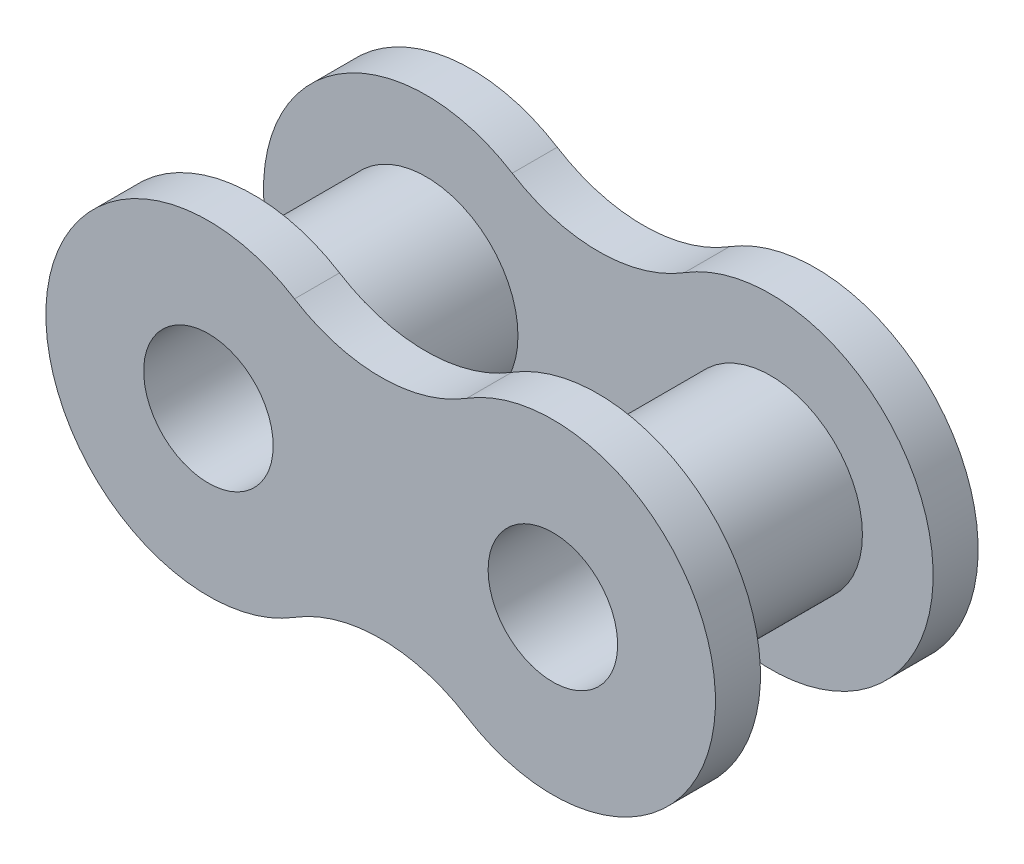
ISO-10303-21;
HEADER;
FILE_DESCRIPTION(('STEP AP214'),'2;1');
FILE_NAME('part.step','',(''),(''),'','','');
FILE_SCHEMA(('AUTOMOTIVE_DESIGN { 1 0 10303 214 1 1 1 1 }'));
ENDSEC;
DATA;
#1=APPLICATION_CONTEXT('core data for automotive mechanical design processes');
#2=APPLICATION_PROTOCOL_DEFINITION('international standard','automotive_design',2000,#1);
#3=PRODUCT_CONTEXT('',#1,'mechanical');
#4=PRODUCT('Part','Part','',(#3));
#5=PRODUCT_RELATED_PRODUCT_CATEGORY('part','',(#4));
#6=PRODUCT_DEFINITION_FORMATION('','',#4);
#7=PRODUCT_DEFINITION_CONTEXT('part definition',#1,'design');
#8=PRODUCT_DEFINITION('design','',#6,#7);
#9=PRODUCT_DEFINITION_SHAPE('','',#8);
#10=(LENGTH_UNIT() NAMED_UNIT(*) SI_UNIT(.MILLI.,.METRE.));
#11=(NAMED_UNIT(*) PLANE_ANGLE_UNIT() SI_UNIT($,.RADIAN.));
#12=(NAMED_UNIT(*) SI_UNIT($,.STERADIAN.) SOLID_ANGLE_UNIT());
#13=UNCERTAINTY_MEASURE_WITH_UNIT(LENGTH_MEASURE(1.E-05),#10,'distance_accuracy_value','');
#14=(GEOMETRIC_REPRESENTATION_CONTEXT(3) GLOBAL_UNCERTAINTY_ASSIGNED_CONTEXT((#13)) GLOBAL_UNIT_ASSIGNED_CONTEXT((#10,
#11,#12)) REPRESENTATION_CONTEXT('',''));
#15=CARTESIAN_POINT('',(0.,0.,0.));
#16=DIRECTION('',(0.,0.,1.));
#17=DIRECTION('',(1.,0.,0.));
#18=AXIS2_PLACEMENT_3D('',#15,#16,#17);
#19=CARTESIAN_POINT('',(2.38125,3.81337987584505,2.3876));
#20=DIRECTION('',(0.,0.,1.));
#21=DIRECTION('',(1.,0.,0.));
#22=AXIS2_PLACEMENT_3D('',#19,#20,#21);
#23=PLANE('',#22);
#24=CARTESIAN_POINT('',(0.,7.62675975169009,2.3876));
#25=DIRECTION('',(0.,0.,-1.));
#26=DIRECTION('',(1.,0.,0.));
#27=AXIS2_PLACEMENT_3D('',#24,#25,#26);
#28=CIRCLE('',#27,4.4958);
#29=CARTESIAN_POINT('',(2.38125,3.81337987584505,2.3876));
#30=VERTEX_POINT('',#29);
#31=CARTESIAN_POINT('',(-2.38125,3.81337987584505,2.3876));
#32=VERTEX_POINT('',#31);
#33=EDGE_CURVE('E190',#30,#32,#28,.T.);
#34=ORIENTED_EDGE('',*,*,#33,.F.);
#35=CARTESIAN_POINT('',(4.7625,0.,2.3876));
#36=DIRECTION('',(0.,0.,1.));
#37=DIRECTION('',(-1.,0.,0.));
#38=AXIS2_PLACEMENT_3D('',#35,#36,#37);
#39=CIRCLE('',#38,4.4958);
#40=CARTESIAN_POINT('',(2.38125,-3.81337987584505,2.3876));
#41=VERTEX_POINT('',#40);
#42=EDGE_CURVE('E86',#41,#30,#39,.T.);
#43=ORIENTED_EDGE('',*,*,#42,.F.);
#44=CARTESIAN_POINT('',(0.,-7.62675975169009,2.3876));
#45=DIRECTION('',(0.,0.,-1.));
#46=DIRECTION('',(-1.,0.,0.));
#47=AXIS2_PLACEMENT_3D('',#44,#45,#46);
#48=CIRCLE('',#47,4.4958);
#49=CARTESIAN_POINT('',(-2.38125,-3.81337987584505,2.3876));
#50=VERTEX_POINT('',#49);
#51=EDGE_CURVE('E80',#50,#41,#48,.T.);
#52=ORIENTED_EDGE('',*,*,#51,.F.);
#53=CARTESIAN_POINT('',(-4.7625,0.,2.3876));
#54=DIRECTION('',(0.,0.,1.));
#55=DIRECTION('',(1.,0.,0.));
#56=AXIS2_PLACEMENT_3D('',#53,#54,#55);
#57=CIRCLE('',#56,4.4958);
#58=EDGE_CURVE('E205',#32,#50,#57,.T.);
#59=ORIENTED_EDGE('',*,*,#58,.F.);
#60=EDGE_LOOP('',(#34,#43,#52,#59));
#61=FACE_BOUND('',#60,.T.);
#62=CARTESIAN_POINT('',(-4.7625,0.,2.3876));
#63=DIRECTION('',(0.,0.,1.));
#64=DIRECTION('',(1.,0.,0.));
#65=AXIS2_PLACEMENT_3D('',#62,#63,#64);
#66=CIRCLE('',#65,2.54);
#67=CARTESIAN_POINT('',(-2.2225,0.,2.3876));
#68=VERTEX_POINT('',#67);
#69=EDGE_CURVE('E54',#68,#68,#66,.T.);
#70=ORIENTED_EDGE('',*,*,#69,.T.);
#71=EDGE_LOOP('',(#70));
#72=FACE_BOUND('',#71,.T.);
#73=CARTESIAN_POINT('',(4.7625,0.,2.3876));
#74=DIRECTION('',(0.,0.,1.));
#75=DIRECTION('',(1.,0.,0.));
#76=AXIS2_PLACEMENT_3D('',#73,#74,#75);
#77=CIRCLE('',#76,2.54);
#78=CARTESIAN_POINT('',(7.3025,0.,2.3876));
#79=VERTEX_POINT('',#78);
#80=EDGE_CURVE('E11',#79,#79,#77,.F.);
#81=ORIENTED_EDGE('',*,*,#80,.F.);
#82=EDGE_LOOP('',(#81));
#83=FACE_BOUND('',#82,.T.);
#84=ADVANCED_FACE('F44',(#61,#72,#83),#23,.F.);
#85=CARTESIAN_POINT('',(-4.7625,0.,2.3876));
#86=DIRECTION('',(0.,0.,-1.));
#87=DIRECTION('',(-1.,0.,0.));
#88=AXIS2_PLACEMENT_3D('',#85,#86,#87);
#89=CYLINDRICAL_SURFACE('',#88,2.54);
#90=ORIENTED_EDGE('',*,*,#69,.F.);
#91=EDGE_LOOP('',(#90));
#92=FACE_BOUND('',#91,.T.);
#93=CARTESIAN_POINT('',(-4.7625,0.,-2.3876));
#94=DIRECTION('',(0.,0.,1.));
#95=DIRECTION('',(1.,0.,0.));
#96=AXIS2_PLACEMENT_3D('',#93,#94,#95);
#97=CIRCLE('',#96,2.54);
#98=CARTESIAN_POINT('',(-2.2225,0.,-2.3876));
#99=VERTEX_POINT('',#98);
#100=EDGE_CURVE('E181',#99,#99,#97,.T.);
#101=ORIENTED_EDGE('',*,*,#100,.T.);
#102=EDGE_LOOP('',(#101));
#103=FACE_BOUND('',#102,.T.);
#104=ADVANCED_FACE('F46',(#92,#103),#89,.T.);
#105=CARTESIAN_POINT('',(-4.7625,0.,2.3876));
#106=DIRECTION('',(0.,0.,-1.));
#107=DIRECTION('',(-1.,0.,0.));
#108=AXIS2_PLACEMENT_3D('',#105,#106,#107);
#109=CYLINDRICAL_SURFACE('',#108,1.7907);
#110=CARTESIAN_POINT('',(-4.7625,0.,3.6322));
#111=DIRECTION('',(0.,0.,1.));
#112=DIRECTION('',(1.,0.,0.));
#113=AXIS2_PLACEMENT_3D('',#110,#111,#112);
#114=CIRCLE('',#113,1.7907);
#115=CARTESIAN_POINT('',(-2.9718,0.,3.6322));
#116=VERTEX_POINT('',#115);
#117=EDGE_CURVE('E186',#116,#116,#114,.T.);
#118=ORIENTED_EDGE('',*,*,#117,.T.);
#119=EDGE_LOOP('',(#118));
#120=FACE_BOUND('',#119,.T.);
#121=CARTESIAN_POINT('',(-4.7625,0.,-3.6322));
#122=DIRECTION('',(0.,0.,1.));
#123=DIRECTION('',(1.,0.,0.));
#124=AXIS2_PLACEMENT_3D('',#121,#122,#123);
#125=CIRCLE('',#124,1.7907);
#126=CARTESIAN_POINT('',(-2.9718,0.,-3.6322));
#127=VERTEX_POINT('',#126);
#128=EDGE_CURVE('E161',#127,#127,#125,.T.);
#129=ORIENTED_EDGE('',*,*,#128,.F.);
#130=EDGE_LOOP('',(#129));
#131=FACE_BOUND('',#130,.T.);
#132=ADVANCED_FACE('F257',(#120,#131),#109,.F.);
#133=CARTESIAN_POINT('',(2.38125,3.81337987584505,3.6322));
#134=DIRECTION('',(0.,0.,1.));
#135=DIRECTION('',(1.,0.,0.));
#136=AXIS2_PLACEMENT_3D('',#133,#134,#135);
#137=PLANE('',#136);
#138=ORIENTED_EDGE('',*,*,#117,.F.);
#139=EDGE_LOOP('',(#138));
#140=FACE_BOUND('',#139,.T.);
#141=CARTESIAN_POINT('',(0.,7.62675975169009,3.6322));
#142=DIRECTION('',(0.,0.,-1.));
#143=DIRECTION('',(1.,0.,0.));
#144=AXIS2_PLACEMENT_3D('',#141,#142,#143);
#145=CIRCLE('',#144,4.4958);
#146=CARTESIAN_POINT('',(2.38125,3.81337987584505,3.6322));
#147=VERTEX_POINT('',#146);
#148=CARTESIAN_POINT('',(-2.38125,3.81337987584505,3.6322));
#149=VERTEX_POINT('',#148);
#150=EDGE_CURVE('E191',#147,#149,#145,.T.);
#151=ORIENTED_EDGE('',*,*,#150,.T.);
#152=CARTESIAN_POINT('',(-4.7625,0.,3.6322));
#153=DIRECTION('',(0.,0.,1.));
#154=DIRECTION('',(1.,0.,0.));
#155=AXIS2_PLACEMENT_3D('',#152,#153,#154);
#156=CIRCLE('',#155,4.4958);
#157=CARTESIAN_POINT('',(-2.38125,-3.81337987584505,3.6322));
#158=VERTEX_POINT('',#157);
#159=EDGE_CURVE('E94',#149,#158,#156,.T.);
#160=ORIENTED_EDGE('',*,*,#159,.T.);
#161=CARTESIAN_POINT('',(0.,-7.62675975169009,3.6322));
#162=DIRECTION('',(0.,0.,-1.));
#163=DIRECTION('',(-1.,0.,0.));
#164=AXIS2_PLACEMENT_3D('',#161,#162,#163);
#165=CIRCLE('',#164,4.4958);
#166=CARTESIAN_POINT('',(2.38125,-3.81337987584505,3.6322));
#167=VERTEX_POINT('',#166);
#168=EDGE_CURVE('E196',#158,#167,#165,.T.);
#169=ORIENTED_EDGE('',*,*,#168,.T.);
#170=CARTESIAN_POINT('',(4.7625,0.,3.6322));
#171=DIRECTION('',(0.,0.,1.));
#172=DIRECTION('',(-1.,0.,0.));
#173=AXIS2_PLACEMENT_3D('',#170,#171,#172);
#174=CIRCLE('',#173,4.4958);
#175=EDGE_CURVE('E62',#167,#147,#174,.T.);
#176=ORIENTED_EDGE('',*,*,#175,.T.);
#177=EDGE_LOOP('',(#151,#160,#169,#176));
#178=FACE_BOUND('',#177,.T.);
#179=CARTESIAN_POINT('',(4.7625,0.,3.6322));
#180=DIRECTION('',(0.,0.,1.));
#181=DIRECTION('',(-1.,0.,0.));
#182=AXIS2_PLACEMENT_3D('',#179,#180,#181);
#183=CIRCLE('',#182,1.7907);
#184=CARTESIAN_POINT('',(2.9718,0.,3.6322));
#185=VERTEX_POINT('',#184);
#186=EDGE_CURVE('E182',#185,#185,#183,.T.);
#187=ORIENTED_EDGE('',*,*,#186,.F.);
#188=EDGE_LOOP('',(#187));
#189=FACE_BOUND('',#188,.T.);
#190=ADVANCED_FACE('F263',(#140,#178,#189),#137,.T.);
#191=CARTESIAN_POINT('',(0.,7.62675975169009,3.6322));
#192=DIRECTION('',(0.,0.,-1.));
#193=DIRECTION('',(-1.,0.,0.));
#194=AXIS2_PLACEMENT_3D('',#191,#192,#193);
#195=CYLINDRICAL_SURFACE('',#194,4.4958);
#196=ORIENTED_EDGE('',*,*,#33,.T.);
#197=DIRECTION('',(0.,0.,-1.));
#198=VECTOR('',#197,1.);
#199=CARTESIAN_POINT('',(-2.38125,3.81337987584505,3.6322));
#200=LINE('',#199,#198);
#201=EDGE_CURVE('E220',#149,#32,#200,.T.);
#202=ORIENTED_EDGE('',*,*,#201,.F.);
#203=ORIENTED_EDGE('',*,*,#150,.F.);
#204=DIRECTION('',(0.,0.,-1.));
#205=VECTOR('',#204,1.);
#206=CARTESIAN_POINT('',(2.38125,3.81337987584505,3.6322));
#207=LINE('',#206,#205);
#208=EDGE_CURVE('E201',#147,#30,#207,.T.);
#209=ORIENTED_EDGE('',*,*,#208,.T.);
#210=EDGE_LOOP('',(#196,#202,#203,#209));
#211=FACE_BOUND('',#210,.T.);
#212=ADVANCED_FACE('F275',(#211),#195,.F.);
#213=CARTESIAN_POINT('',(-4.7625,0.,3.6322));
#214=DIRECTION('',(0.,0.,-1.));
#215=DIRECTION('',(-1.,0.,0.));
#216=AXIS2_PLACEMENT_3D('',#213,#214,#215);
#217=CYLINDRICAL_SURFACE('',#216,4.4958);
#218=ORIENTED_EDGE('',*,*,#58,.T.);
#219=DIRECTION('',(0.,0.,-1.));
#220=VECTOR('',#219,1.);
#221=CARTESIAN_POINT('',(-2.38125,-3.81337987584505,3.6322));
#222=LINE('',#221,#220);
#223=EDGE_CURVE('E217',#158,#50,#222,.T.);
#224=ORIENTED_EDGE('',*,*,#223,.F.);
#225=ORIENTED_EDGE('',*,*,#159,.F.);
#226=ORIENTED_EDGE('',*,*,#201,.T.);
#227=EDGE_LOOP('',(#218,#224,#225,#226));
#228=FACE_BOUND('',#227,.T.);
#229=ADVANCED_FACE('F272',(#228),#217,.T.);
#230=CARTESIAN_POINT('',(0.,-7.62675975169009,3.6322));
#231=DIRECTION('',(0.,0.,-1.));
#232=DIRECTION('',(-1.,0.,0.));
#233=AXIS2_PLACEMENT_3D('',#230,#231,#232);
#234=CYLINDRICAL_SURFACE('',#233,4.4958);
#235=ORIENTED_EDGE('',*,*,#51,.T.);
#236=DIRECTION('',(0.,0.,-1.));
#237=VECTOR('',#236,1.);
#238=CARTESIAN_POINT('',(2.38125,-3.81337987584505,3.6322));
#239=LINE('',#238,#237);
#240=EDGE_CURVE('E214',#167,#41,#239,.T.);
#241=ORIENTED_EDGE('',*,*,#240,.F.);
#242=ORIENTED_EDGE('',*,*,#168,.F.);
#243=ORIENTED_EDGE('',*,*,#223,.T.);
#244=EDGE_LOOP('',(#235,#241,#242,#243));
#245=FACE_BOUND('',#244,.T.);
#246=ADVANCED_FACE('F269',(#245),#234,.F.);
#247=CARTESIAN_POINT('',(4.7625,0.,3.6322));
#248=DIRECTION('',(0.,0.,-1.));
#249=DIRECTION('',(-1.,0.,0.));
#250=AXIS2_PLACEMENT_3D('',#247,#248,#249);
#251=CYLINDRICAL_SURFACE('',#250,4.4958);
#252=ORIENTED_EDGE('',*,*,#42,.T.);
#253=ORIENTED_EDGE('',*,*,#208,.F.);
#254=ORIENTED_EDGE('',*,*,#175,.F.);
#255=ORIENTED_EDGE('',*,*,#240,.T.);
#256=EDGE_LOOP('',(#252,#253,#254,#255));
#257=FACE_BOUND('',#256,.T.);
#258=ADVANCED_FACE('F265',(#257),#251,.T.);
#259=CARTESIAN_POINT('',(4.7625,0.,3.6322));
#260=DIRECTION('',(0.,0.,-1.));
#261=DIRECTION('',(-1.,0.,0.));
#262=AXIS2_PLACEMENT_3D('',#259,#260,#261);
#263=CYLINDRICAL_SURFACE('',#262,1.7907);
#264=ORIENTED_EDGE('',*,*,#186,.T.);
#265=EDGE_LOOP('',(#264));
#266=FACE_BOUND('',#265,.T.);
#267=CARTESIAN_POINT('',(4.7625,0.,-3.6322));
#268=DIRECTION('',(0.,0.,1.));
#269=DIRECTION('',(-1.,0.,0.));
#270=AXIS2_PLACEMENT_3D('',#267,#268,#269);
#271=CIRCLE('',#270,1.7907);
#272=CARTESIAN_POINT('',(2.9718,0.,-3.6322));
#273=VERTEX_POINT('',#272);
#274=EDGE_CURVE('E291',#273,#273,#271,.T.);
#275=ORIENTED_EDGE('',*,*,#274,.F.);
#276=EDGE_LOOP('',(#275));
#277=FACE_BOUND('',#276,.T.);
#278=ADVANCED_FACE('F268',(#266,#277),#263,.F.);
#279=CARTESIAN_POINT('',(4.7625,0.,2.3876));
#280=DIRECTION('',(0.,0.,-1.));
#281=DIRECTION('',(-1.,0.,0.));
#282=AXIS2_PLACEMENT_3D('',#279,#280,#281);
#283=CYLINDRICAL_SURFACE('',#282,2.54);
#284=ORIENTED_EDGE('',*,*,#80,.T.);
#285=EDGE_LOOP('',(#284));
#286=FACE_BOUND('',#285,.T.);
#287=CARTESIAN_POINT('',(4.7625,0.,-2.3876));
#288=DIRECTION('',(0.,0.,1.));
#289=DIRECTION('',(-1.,0.,0.));
#290=AXIS2_PLACEMENT_3D('',#287,#288,#289);
#291=CIRCLE('',#290,2.54);
#292=CARTESIAN_POINT('',(2.2225,0.,-2.3876));
#293=VERTEX_POINT('',#292);
#294=EDGE_CURVE('E133',#293,#293,#291,.T.);
#295=ORIENTED_EDGE('',*,*,#294,.T.);
#296=EDGE_LOOP('',(#295));
#297=FACE_BOUND('',#296,.T.);
#298=ADVANCED_FACE('F298',(#286,#297),#283,.T.);
#299=CARTESIAN_POINT('',(0.,7.62675975169009,-3.6322));
#300=DIRECTION('',(0.,0.,1.));
#301=DIRECTION('',(1.,0.,0.));
#302=AXIS2_PLACEMENT_3D('',#299,#300,#301);
#303=CYLINDRICAL_SURFACE('',#302,4.4958);
#304=CARTESIAN_POINT('',(0.,7.62675975169009,-2.3876));
#305=DIRECTION('',(0.,0.,-1.));
#306=DIRECTION('',(1.,0.,0.));
#307=AXIS2_PLACEMENT_3D('',#304,#305,#306);
#308=CIRCLE('',#307,4.4958);
#309=CARTESIAN_POINT('',(2.38125,3.81337987584505,-2.3876));
#310=VERTEX_POINT('',#309);
#311=CARTESIAN_POINT('',(-2.38125,3.81337987584505,-2.3876));
#312=VERTEX_POINT('',#311);
#313=EDGE_CURVE('E127',#310,#312,#308,.T.);
#314=ORIENTED_EDGE('',*,*,#313,.F.);
#315=DIRECTION('',(0.,0.,1.));
#316=VECTOR('',#315,1.);
#317=CARTESIAN_POINT('',(2.38125,3.81337987584505,-3.6322));
#318=LINE('',#317,#316);
#319=CARTESIAN_POINT('',(2.38125,3.81337987584505,-3.6322));
#320=VERTEX_POINT('',#319);
#321=EDGE_CURVE('E121',#320,#310,#318,.T.);
#322=ORIENTED_EDGE('',*,*,#321,.F.);
#323=CARTESIAN_POINT('',(0.,7.62675975169009,-3.6322));
#324=DIRECTION('',(0.,0.,-1.));
#325=DIRECTION('',(1.,0.,0.));
#326=AXIS2_PLACEMENT_3D('',#323,#324,#325);
#327=CIRCLE('',#326,4.4958);
#328=CARTESIAN_POINT('',(-2.38125,3.81337987584505,-3.6322));
#329=VERTEX_POINT('',#328);
#330=EDGE_CURVE('E124',#320,#329,#327,.T.);
#331=ORIENTED_EDGE('',*,*,#330,.T.);
#332=DIRECTION('',(0.,0.,1.));
#333=VECTOR('',#332,1.);
#334=CARTESIAN_POINT('',(-2.38125,3.81337987584505,-3.6322));
#335=LINE('',#334,#333);
#336=EDGE_CURVE('E157',#329,#312,#335,.T.);
#337=ORIENTED_EDGE('',*,*,#336,.T.);
#338=EDGE_LOOP('',(#314,#322,#331,#337));
#339=FACE_BOUND('',#338,.T.);
#340=ADVANCED_FACE('F123',(#339),#303,.F.);
#341=CARTESIAN_POINT('',(4.7625,0.,-3.6322));
#342=DIRECTION('',(0.,0.,1.));
#343=DIRECTION('',(1.,0.,0.));
#344=AXIS2_PLACEMENT_3D('',#341,#342,#343);
#345=CYLINDRICAL_SURFACE('',#344,4.4958);
#346=CARTESIAN_POINT('',(4.7625,0.,-2.3876));
#347=DIRECTION('',(0.,0.,1.));
#348=DIRECTION('',(-1.,0.,0.));
#349=AXIS2_PLACEMENT_3D('',#346,#347,#348);
#350=CIRCLE('',#349,4.4958);
#351=CARTESIAN_POINT('',(2.38125,-3.81337987584505,-2.3876));
#352=VERTEX_POINT('',#351);
#353=EDGE_CURVE('E160',#352,#310,#350,.T.);
#354=ORIENTED_EDGE('',*,*,#353,.F.);
#355=DIRECTION('',(0.,0.,1.));
#356=VECTOR('',#355,1.);
#357=CARTESIAN_POINT('',(2.38125,-3.81337987584505,-3.6322));
#358=LINE('',#357,#356);
#359=CARTESIAN_POINT('',(2.38125,-3.81337987584505,-3.6322));
#360=VERTEX_POINT('',#359);
#361=EDGE_CURVE('E134',#360,#352,#358,.T.);
#362=ORIENTED_EDGE('',*,*,#361,.F.);
#363=CARTESIAN_POINT('',(4.7625,0.,-3.6322));
#364=DIRECTION('',(0.,0.,1.));
#365=DIRECTION('',(-1.,0.,0.));
#366=AXIS2_PLACEMENT_3D('',#363,#364,#365);
#367=CIRCLE('',#366,4.4958);
#368=EDGE_CURVE('E140',#360,#320,#367,.T.);
#369=ORIENTED_EDGE('',*,*,#368,.T.);
#370=ORIENTED_EDGE('',*,*,#321,.T.);
#371=EDGE_LOOP('',(#354,#362,#369,#370));
#372=FACE_BOUND('',#371,.T.);
#373=ADVANCED_FACE('F147',(#372),#345,.T.);
#374=CARTESIAN_POINT('',(0.,-7.62675975169009,-3.6322));
#375=DIRECTION('',(0.,0.,1.));
#376=DIRECTION('',(1.,0.,0.));
#377=AXIS2_PLACEMENT_3D('',#374,#375,#376);
#378=CYLINDRICAL_SURFACE('',#377,4.4958);
#379=CARTESIAN_POINT('',(0.,-7.62675975169009,-2.3876));
#380=DIRECTION('',(0.,0.,-1.));
#381=DIRECTION('',(-1.,0.,0.));
#382=AXIS2_PLACEMENT_3D('',#379,#380,#381);
#383=CIRCLE('',#382,4.4958);
#384=CARTESIAN_POINT('',(-2.38125,-3.81337987584505,-2.3876));
#385=VERTEX_POINT('',#384);
#386=EDGE_CURVE('E164',#385,#352,#383,.T.);
#387=ORIENTED_EDGE('',*,*,#386,.F.);
#388=DIRECTION('',(0.,0.,1.));
#389=VECTOR('',#388,1.);
#390=CARTESIAN_POINT('',(-2.38125,-3.81337987584505,-3.6322));
#391=LINE('',#390,#389);
#392=CARTESIAN_POINT('',(-2.38125,-3.81337987584505,-3.6322));
#393=VERTEX_POINT('',#392);
#394=EDGE_CURVE('E173',#393,#385,#391,.T.);
#395=ORIENTED_EDGE('',*,*,#394,.F.);
#396=CARTESIAN_POINT('',(0.,-7.62675975169009,-3.6322));
#397=DIRECTION('',(0.,0.,-1.));
#398=DIRECTION('',(-1.,0.,0.));
#399=AXIS2_PLACEMENT_3D('',#396,#397,#398);
#400=CIRCLE('',#399,4.4958);
#401=EDGE_CURVE('E149',#393,#360,#400,.T.);
#402=ORIENTED_EDGE('',*,*,#401,.T.);
#403=ORIENTED_EDGE('',*,*,#361,.T.);
#404=EDGE_LOOP('',(#387,#395,#402,#403));
#405=FACE_BOUND('',#404,.T.);
#406=ADVANCED_FACE('F241',(#405),#378,.F.);
#407=CARTESIAN_POINT('',(-4.7625,0.,-3.6322));
#408=DIRECTION('',(0.,0.,1.));
#409=DIRECTION('',(1.,0.,0.));
#410=AXIS2_PLACEMENT_3D('',#407,#408,#409);
#411=CYLINDRICAL_SURFACE('',#410,4.4958);
#412=CARTESIAN_POINT('',(-4.7625,0.,-2.3876));
#413=DIRECTION('',(0.,0.,1.));
#414=DIRECTION('',(1.,0.,0.));
#415=AXIS2_PLACEMENT_3D('',#412,#413,#414);
#416=CIRCLE('',#415,4.4958);
#417=EDGE_CURVE('E145',#312,#385,#416,.T.);
#418=ORIENTED_EDGE('',*,*,#417,.F.);
#419=ORIENTED_EDGE('',*,*,#336,.F.);
#420=CARTESIAN_POINT('',(-4.7625,0.,-3.6322));
#421=DIRECTION('',(0.,0.,1.));
#422=DIRECTION('',(1.,0.,0.));
#423=AXIS2_PLACEMENT_3D('',#420,#421,#422);
#424=CIRCLE('',#423,4.4958);
#425=EDGE_CURVE('E143',#329,#393,#424,.T.);
#426=ORIENTED_EDGE('',*,*,#425,.T.);
#427=ORIENTED_EDGE('',*,*,#394,.T.);
#428=EDGE_LOOP('',(#418,#419,#426,#427));
#429=FACE_BOUND('',#428,.T.);
#430=ADVANCED_FACE('F238',(#429),#411,.T.);
#431=CARTESIAN_POINT('',(2.38125,3.81337987584505,-3.6322));
#432=DIRECTION('',(0.,0.,-1.));
#433=DIRECTION('',(1.,0.,0.));
#434=AXIS2_PLACEMENT_3D('',#431,#432,#433);
#435=PLANE('',#434);
#436=ORIENTED_EDGE('',*,*,#274,.T.);
#437=EDGE_LOOP('',(#436));
#438=FACE_BOUND('',#437,.T.);
#439=ORIENTED_EDGE('',*,*,#128,.T.);
#440=EDGE_LOOP('',(#439));
#441=FACE_BOUND('',#440,.T.);
#442=ORIENTED_EDGE('',*,*,#330,.F.);
#443=ORIENTED_EDGE('',*,*,#368,.F.);
#444=ORIENTED_EDGE('',*,*,#401,.F.);
#445=ORIENTED_EDGE('',*,*,#425,.F.);
#446=EDGE_LOOP('',(#442,#443,#444,#445));
#447=FACE_BOUND('',#446,.T.);
#448=ADVANCED_FACE('F138',(#438,#441,#447),#435,.T.);
#449=CARTESIAN_POINT('',(2.38125,3.81337987584505,-2.3876));
#450=DIRECTION('',(0.,0.,-1.));
#451=DIRECTION('',(1.,0.,0.));
#452=AXIS2_PLACEMENT_3D('',#449,#450,#451);
#453=PLANE('',#452);
#454=ORIENTED_EDGE('',*,*,#100,.F.);
#455=EDGE_LOOP('',(#454));
#456=FACE_BOUND('',#455,.T.);
#457=ORIENTED_EDGE('',*,*,#294,.F.);
#458=EDGE_LOOP('',(#457));
#459=FACE_BOUND('',#458,.T.);
#460=ORIENTED_EDGE('',*,*,#313,.T.);
#461=ORIENTED_EDGE('',*,*,#417,.T.);
#462=ORIENTED_EDGE('',*,*,#386,.T.);
#463=ORIENTED_EDGE('',*,*,#353,.T.);
#464=EDGE_LOOP('',(#460,#461,#462,#463));
#465=FACE_BOUND('',#464,.T.);
#466=ADVANCED_FACE('F230',(#456,#459,#465),#453,.F.);
#467=CLOSED_SHELL('',(#84,#104,#132,#190,#212,#229,#246,#258,#278,#298,#340,#373,#406,#430,#448,#466));
#468=MANIFOLD_SOLID_BREP('B2',#467);
#469=ADVANCED_BREP_SHAPE_REPRESENTATION('',(#18,#468),#14);
#470=SHAPE_DEFINITION_REPRESENTATION(#9,#469);
ENDSEC;
END-ISO-10303-21;
